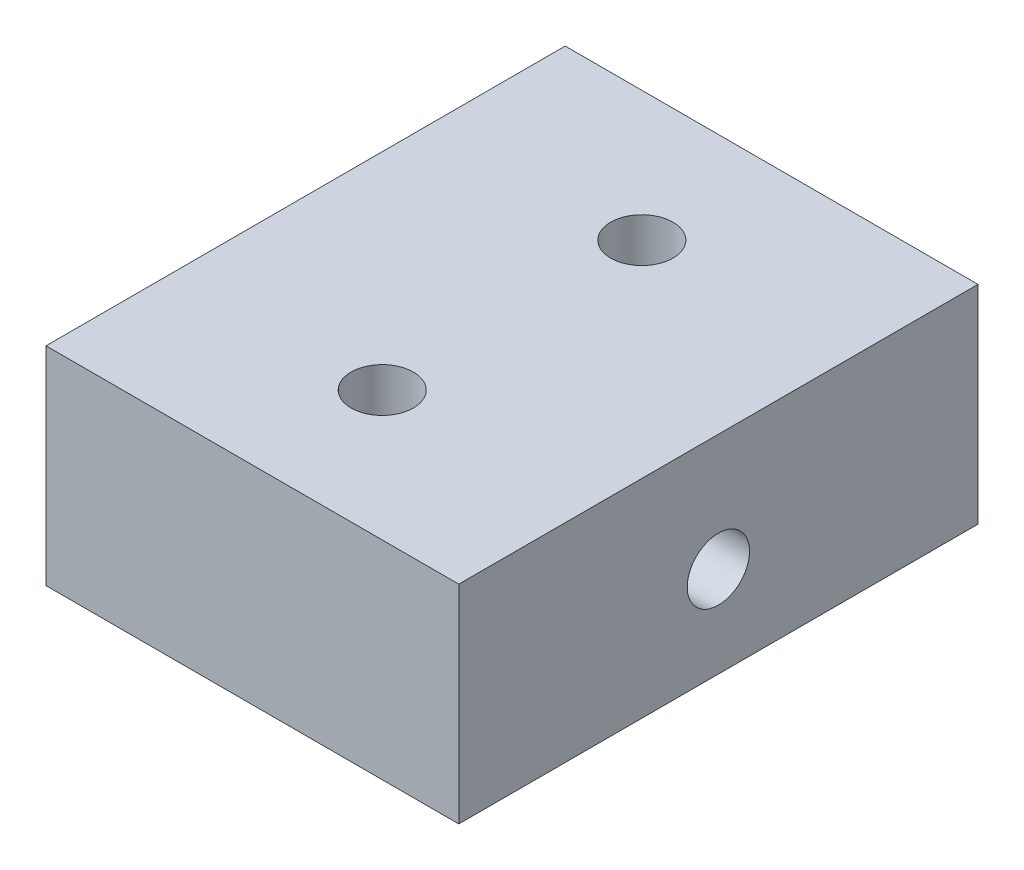
ISO-10303-21;
HEADER;
FILE_DESCRIPTION(('STEP AP214'),'2;1');
FILE_NAME('part.step','',(''),(''),'','','');
FILE_SCHEMA(('AUTOMOTIVE_DESIGN { 1 0 10303 214 1 1 1 1 }'));
ENDSEC;
DATA;
#1=APPLICATION_CONTEXT('core data for automotive mechanical design processes');
#2=APPLICATION_PROTOCOL_DEFINITION('international standard','automotive_design',2000,#1);
#3=PRODUCT_CONTEXT('',#1,'mechanical');
#4=PRODUCT('Part','Part','',(#3));
#5=PRODUCT_RELATED_PRODUCT_CATEGORY('part','',(#4));
#6=PRODUCT_DEFINITION_FORMATION('','',#4);
#7=PRODUCT_DEFINITION_CONTEXT('part definition',#1,'design');
#8=PRODUCT_DEFINITION('design','',#6,#7);
#9=PRODUCT_DEFINITION_SHAPE('','',#8);
#10=(LENGTH_UNIT() NAMED_UNIT(*) SI_UNIT(.MILLI.,.METRE.));
#11=(NAMED_UNIT(*) PLANE_ANGLE_UNIT() SI_UNIT($,.RADIAN.));
#12=(NAMED_UNIT(*) SI_UNIT($,.STERADIAN.) SOLID_ANGLE_UNIT());
#13=UNCERTAINTY_MEASURE_WITH_UNIT(LENGTH_MEASURE(1.E-05),#10,'distance_accuracy_value','');
#14=(GEOMETRIC_REPRESENTATION_CONTEXT(3) GLOBAL_UNCERTAINTY_ASSIGNED_CONTEXT((#13)) GLOBAL_UNIT_ASSIGNED_CONTEXT((#10,
#11,#12)) REPRESENTATION_CONTEXT('',''));
#15=CARTESIAN_POINT('',(0.,0.,0.));
#16=DIRECTION('',(0.,0.,1.));
#17=DIRECTION('',(1.,0.,0.));
#18=AXIS2_PLACEMENT_3D('',#15,#16,#17);
#19=CARTESIAN_POINT('',(0.,0.,20.));
#20=DIRECTION('',(1.,0.,0.));
#21=DIRECTION('',(0.,0.,-1.));
#22=AXIS2_PLACEMENT_3D('',#19,#20,#21);
#23=PLANE('',#22);
#24=CARTESIAN_POINT('',(0.,3.5,10.));
#25=DIRECTION('',(1.,0.,0.));
#26=DIRECTION('',(0.,0.,-1.));
#27=AXIS2_PLACEMENT_3D('',#24,#25,#26);
#28=CIRCLE('',#27,1.2);
#29=CARTESIAN_POINT('',(0.,3.5,8.8));
#30=VERTEX_POINT('',#29);
#31=EDGE_CURVE('E103',#30,#30,#28,.T.);
#32=ORIENTED_EDGE('',*,*,#31,.T.);
#33=EDGE_LOOP('',(#32));
#34=FACE_BOUND('',#33,.T.);
#35=DIRECTION('',(0.,-1.,0.));
#36=VECTOR('',#35,1.);
#37=CARTESIAN_POINT('',(0.,0.,0.));
#38=LINE('',#37,#36);
#39=CARTESIAN_POINT('',(0.,8.,0.));
#40=VERTEX_POINT('',#39);
#41=CARTESIAN_POINT('',(0.,0.,0.));
#42=VERTEX_POINT('',#41);
#43=EDGE_CURVE('E100',#40,#42,#38,.T.);
#44=ORIENTED_EDGE('',*,*,#43,.T.);
#45=DIRECTION('',(0.,0.,-1.));
#46=VECTOR('',#45,1.);
#47=CARTESIAN_POINT('',(0.,0.,20.));
#48=LINE('',#47,#46);
#49=CARTESIAN_POINT('',(0.,0.,20.));
#50=VERTEX_POINT('',#49);
#51=EDGE_CURVE('E11',#50,#42,#48,.T.);
#52=ORIENTED_EDGE('',*,*,#51,.F.);
#53=DIRECTION('',(0.,-1.,0.));
#54=VECTOR('',#53,1.);
#55=CARTESIAN_POINT('',(0.,0.,20.));
#56=LINE('',#55,#54);
#57=CARTESIAN_POINT('',(0.,8.,20.));
#58=VERTEX_POINT('',#57);
#59=EDGE_CURVE('E88',#58,#50,#56,.T.);
#60=ORIENTED_EDGE('',*,*,#59,.F.);
#61=DIRECTION('',(0.,0.,-1.));
#62=VECTOR('',#61,1.);
#63=CARTESIAN_POINT('',(0.,8.,20.));
#64=LINE('',#63,#62);
#65=EDGE_CURVE('E96',#58,#40,#64,.T.);
#66=ORIENTED_EDGE('',*,*,#65,.T.);
#67=EDGE_LOOP('',(#44,#52,#60,#66));
#68=FACE_BOUND('',#67,.T.);
#69=ADVANCED_FACE('F37',(#34,#68),#23,.F.);
#70=CARTESIAN_POINT('',(0.,0.,20.));
#71=DIRECTION('',(0.,1.,0.));
#72=DIRECTION('',(0.,0.,1.));
#73=AXIS2_PLACEMENT_3D('',#70,#71,#72);
#74=PLANE('',#73);
#75=CARTESIAN_POINT('',(7.95,0.,5.));
#76=DIRECTION('',(0.,1.,0.));
#77=DIRECTION('',(0.,0.,-1.));
#78=AXIS2_PLACEMENT_3D('',#75,#76,#77);
#79=CIRCLE('',#78,1.2);
#80=CARTESIAN_POINT('',(7.95,0.,3.8));
#81=VERTEX_POINT('',#80);
#82=EDGE_CURVE('E123',#81,#81,#79,.T.);
#83=ORIENTED_EDGE('',*,*,#82,.T.);
#84=EDGE_LOOP('',(#83));
#85=FACE_BOUND('',#84,.T.);
#86=CARTESIAN_POINT('',(7.95,0.,15.));
#87=DIRECTION('',(0.,1.,0.));
#88=DIRECTION('',(0.,0.,1.));
#89=AXIS2_PLACEMENT_3D('',#86,#87,#88);
#90=CIRCLE('',#89,1.2);
#91=CARTESIAN_POINT('',(7.95,0.,16.2));
#92=VERTEX_POINT('',#91);
#93=EDGE_CURVE('E117',#92,#92,#90,.T.);
#94=ORIENTED_EDGE('',*,*,#93,.T.);
#95=EDGE_LOOP('',(#94));
#96=FACE_BOUND('',#95,.T.);
#97=DIRECTION('',(1.,0.,0.));
#98=VECTOR('',#97,1.);
#99=CARTESIAN_POINT('',(0.,0.,0.));
#100=LINE('',#99,#98);
#101=CARTESIAN_POINT('',(15.9,0.,0.));
#102=VERTEX_POINT('',#101);
#103=EDGE_CURVE('E92',#42,#102,#100,.T.);
#104=ORIENTED_EDGE('',*,*,#103,.T.);
#105=DIRECTION('',(0.,0.,-1.));
#106=VECTOR('',#105,1.);
#107=CARTESIAN_POINT('',(15.9,0.,20.));
#108=LINE('',#107,#106);
#109=CARTESIAN_POINT('',(15.9,0.,20.));
#110=VERTEX_POINT('',#109);
#111=EDGE_CURVE('E45',#110,#102,#108,.T.);
#112=ORIENTED_EDGE('',*,*,#111,.F.);
#113=DIRECTION('',(1.,0.,0.));
#114=VECTOR('',#113,1.);
#115=CARTESIAN_POINT('',(0.,0.,20.));
#116=LINE('',#115,#114);
#117=EDGE_CURVE('E83',#50,#110,#116,.T.);
#118=ORIENTED_EDGE('',*,*,#117,.F.);
#119=ORIENTED_EDGE('',*,*,#51,.T.);
#120=EDGE_LOOP('',(#104,#112,#118,#119));
#121=FACE_BOUND('',#120,.T.);
#122=ADVANCED_FACE('F91',(#85,#96,#121),#74,.F.);
#123=CARTESIAN_POINT('',(15.9,0.,20.));
#124=DIRECTION('',(-1.,0.,0.));
#125=DIRECTION('',(0.,0.,1.));
#126=AXIS2_PLACEMENT_3D('',#123,#124,#125);
#127=PLANE('',#126);
#128=CARTESIAN_POINT('',(15.9,3.5,10.));
#129=DIRECTION('',(1.,0.,0.));
#130=DIRECTION('',(0.,0.,-1.));
#131=AXIS2_PLACEMENT_3D('',#128,#129,#130);
#132=CIRCLE('',#131,1.2);
#133=CARTESIAN_POINT('',(15.9,3.5,8.8));
#134=VERTEX_POINT('',#133);
#135=EDGE_CURVE('E114',#134,#134,#132,.T.);
#136=ORIENTED_EDGE('',*,*,#135,.F.);
#137=EDGE_LOOP('',(#136));
#138=FACE_BOUND('',#137,.T.);
#139=DIRECTION('',(0.,1.,0.));
#140=VECTOR('',#139,1.);
#141=CARTESIAN_POINT('',(15.9,0.,0.));
#142=LINE('',#141,#140);
#143=CARTESIAN_POINT('',(15.9,8.,0.));
#144=VERTEX_POINT('',#143);
#145=EDGE_CURVE('E70',#102,#144,#142,.T.);
#146=ORIENTED_EDGE('',*,*,#145,.T.);
#147=DIRECTION('',(0.,0.,-1.));
#148=VECTOR('',#147,1.);
#149=CARTESIAN_POINT('',(15.9,8.,20.));
#150=LINE('',#149,#148);
#151=CARTESIAN_POINT('',(15.9,8.,20.));
#152=VERTEX_POINT('',#151);
#153=EDGE_CURVE('E93',#152,#144,#150,.T.);
#154=ORIENTED_EDGE('',*,*,#153,.F.);
#155=DIRECTION('',(0.,1.,0.));
#156=VECTOR('',#155,1.);
#157=CARTESIAN_POINT('',(15.9,0.,20.));
#158=LINE('',#157,#156);
#159=EDGE_CURVE('E86',#110,#152,#158,.T.);
#160=ORIENTED_EDGE('',*,*,#159,.F.);
#161=ORIENTED_EDGE('',*,*,#111,.T.);
#162=EDGE_LOOP('',(#146,#154,#160,#161));
#163=FACE_BOUND('',#162,.T.);
#164=ADVANCED_FACE('F94',(#138,#163),#127,.F.);
#165=CARTESIAN_POINT('',(0.,8.,20.));
#166=DIRECTION('',(0.,-1.,0.));
#167=DIRECTION('',(0.,0.,-1.));
#168=AXIS2_PLACEMENT_3D('',#165,#166,#167);
#169=PLANE('',#168);
#170=CARTESIAN_POINT('',(7.95,8.,5.));
#171=DIRECTION('',(0.,1.,0.));
#172=DIRECTION('',(0.,0.,-1.));
#173=AXIS2_PLACEMENT_3D('',#170,#171,#172);
#174=CIRCLE('',#173,1.2);
#175=CARTESIAN_POINT('',(7.95,8.,3.8));
#176=VERTEX_POINT('',#175);
#177=EDGE_CURVE('E126',#176,#176,#174,.T.);
#178=ORIENTED_EDGE('',*,*,#177,.F.);
#179=EDGE_LOOP('',(#178));
#180=FACE_BOUND('',#179,.T.);
#181=CARTESIAN_POINT('',(7.95,8.,15.));
#182=DIRECTION('',(0.,1.,0.));
#183=DIRECTION('',(0.,0.,1.));
#184=AXIS2_PLACEMENT_3D('',#181,#182,#183);
#185=CIRCLE('',#184,1.2);
#186=CARTESIAN_POINT('',(7.95,8.,16.2));
#187=VERTEX_POINT('',#186);
#188=EDGE_CURVE('E120',#187,#187,#185,.T.);
#189=ORIENTED_EDGE('',*,*,#188,.F.);
#190=EDGE_LOOP('',(#189));
#191=FACE_BOUND('',#190,.T.);
#192=DIRECTION('',(-1.,0.,0.));
#193=VECTOR('',#192,1.);
#194=CARTESIAN_POINT('',(0.,8.,0.));
#195=LINE('',#194,#193);
#196=EDGE_CURVE('E76',#144,#40,#195,.T.);
#197=ORIENTED_EDGE('',*,*,#196,.T.);
#198=ORIENTED_EDGE('',*,*,#65,.F.);
#199=DIRECTION('',(-1.,0.,0.));
#200=VECTOR('',#199,1.);
#201=CARTESIAN_POINT('',(0.,8.,20.));
#202=LINE('',#201,#200);
#203=EDGE_CURVE('E53',#152,#58,#202,.T.);
#204=ORIENTED_EDGE('',*,*,#203,.F.);
#205=ORIENTED_EDGE('',*,*,#153,.T.);
#206=EDGE_LOOP('',(#197,#198,#204,#205));
#207=FACE_BOUND('',#206,.T.);
#208=ADVANCED_FACE('F108',(#180,#191,#207),#169,.F.);
#209=CARTESIAN_POINT('',(0.,0.,20.));
#210=DIRECTION('',(0.,0.,-1.));
#211=DIRECTION('',(-1.,0.,0.));
#212=AXIS2_PLACEMENT_3D('',#209,#210,#211);
#213=PLANE('',#212);
#214=ORIENTED_EDGE('',*,*,#59,.T.);
#215=ORIENTED_EDGE('',*,*,#117,.T.);
#216=ORIENTED_EDGE('',*,*,#159,.T.);
#217=ORIENTED_EDGE('',*,*,#203,.T.);
#218=EDGE_LOOP('',(#214,#215,#216,#217));
#219=FACE_BOUND('',#218,.T.);
#220=ADVANCED_FACE('F84',(#219),#213,.F.);
#221=CARTESIAN_POINT('',(0.,0.,0.));
#222=DIRECTION('',(0.,0.,-1.));
#223=DIRECTION('',(-1.,0.,0.));
#224=AXIS2_PLACEMENT_3D('',#221,#222,#223);
#225=PLANE('',#224);
#226=ORIENTED_EDGE('',*,*,#43,.F.);
#227=ORIENTED_EDGE('',*,*,#196,.F.);
#228=ORIENTED_EDGE('',*,*,#145,.F.);
#229=ORIENTED_EDGE('',*,*,#103,.F.);
#230=EDGE_LOOP('',(#226,#227,#228,#229));
#231=FACE_BOUND('',#230,.T.);
#232=ADVANCED_FACE('F111',(#231),#225,.T.);
#233=CARTESIAN_POINT('',(0.,3.5,10.));
#234=DIRECTION('',(1.,0.,0.));
#235=DIRECTION('',(0.,0.,-1.));
#236=AXIS2_PLACEMENT_3D('',#233,#234,#235);
#237=CYLINDRICAL_SURFACE('',#236,1.2);
#238=ORIENTED_EDGE('',*,*,#31,.F.);
#239=EDGE_LOOP('',(#238));
#240=FACE_BOUND('',#239,.T.);
#241=ORIENTED_EDGE('',*,*,#135,.T.);
#242=EDGE_LOOP('',(#241));
#243=FACE_BOUND('',#242,.T.);
#244=ADVANCED_FACE('F147',(#240,#243),#237,.F.);
#245=CARTESIAN_POINT('',(7.95,0.,15.));
#246=DIRECTION('',(0.,1.,0.));
#247=DIRECTION('',(0.,0.,1.));
#248=AXIS2_PLACEMENT_3D('',#245,#246,#247);
#249=CYLINDRICAL_SURFACE('',#248,1.2);
#250=ORIENTED_EDGE('',*,*,#93,.F.);
#251=EDGE_LOOP('',(#250));
#252=FACE_BOUND('',#251,.T.);
#253=ORIENTED_EDGE('',*,*,#188,.T.);
#254=EDGE_LOOP('',(#253));
#255=FACE_BOUND('',#254,.T.);
#256=ADVANCED_FACE('F137',(#252,#255),#249,.F.);
#257=CARTESIAN_POINT('',(7.95,0.,5.));
#258=DIRECTION('',(0.,1.,0.));
#259=DIRECTION('',(0.,0.,1.));
#260=AXIS2_PLACEMENT_3D('',#257,#258,#259);
#261=CYLINDRICAL_SURFACE('',#260,1.2);
#262=ORIENTED_EDGE('',*,*,#82,.F.);
#263=EDGE_LOOP('',(#262));
#264=FACE_BOUND('',#263,.T.);
#265=ORIENTED_EDGE('',*,*,#177,.T.);
#266=EDGE_LOOP('',(#265));
#267=FACE_BOUND('',#266,.T.);
#268=ADVANCED_FACE('F134',(#264,#267),#261,.F.);
#269=CLOSED_SHELL('',(#69,#122,#164,#208,#220,#232,#244,#256,#268));
#270=MANIFOLD_SOLID_BREP('B2',#269);
#271=ADVANCED_BREP_SHAPE_REPRESENTATION('',(#18,#270),#14);
#272=SHAPE_DEFINITION_REPRESENTATION(#9,#271);
ENDSEC;
END-ISO-10303-21;
